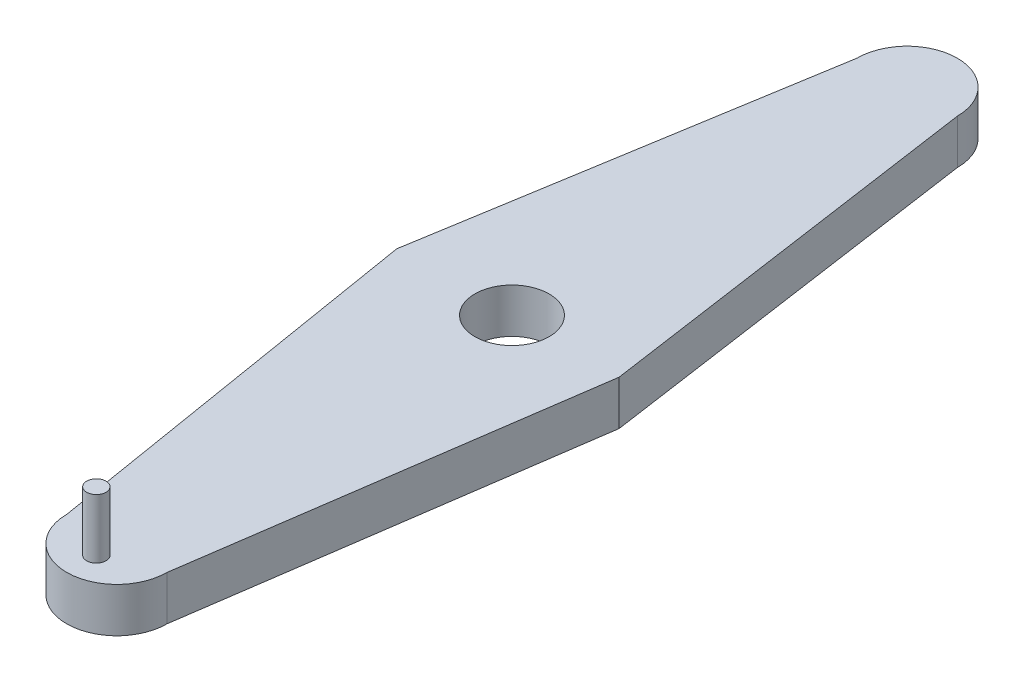
ISO-10303-21;
HEADER;
FILE_DESCRIPTION(('STEP AP214'),'2;1');
FILE_NAME('part.step','',(''),(''),'','','');
FILE_SCHEMA(('AUTOMOTIVE_DESIGN { 1 0 10303 214 1 1 1 1 }'));
ENDSEC;
DATA;
#1=APPLICATION_CONTEXT('core data for automotive mechanical design processes');
#2=APPLICATION_PROTOCOL_DEFINITION('international standard','automotive_design',2000,#1);
#3=PRODUCT_CONTEXT('',#1,'mechanical');
#4=PRODUCT('Part','Part','',(#3));
#5=PRODUCT_RELATED_PRODUCT_CATEGORY('part','',(#4));
#6=PRODUCT_DEFINITION_FORMATION('','',#4);
#7=PRODUCT_DEFINITION_CONTEXT('part definition',#1,'design');
#8=PRODUCT_DEFINITION('design','',#6,#7);
#9=PRODUCT_DEFINITION_SHAPE('','',#8);
#10=(LENGTH_UNIT() NAMED_UNIT(*) SI_UNIT(.MILLI.,.METRE.));
#11=(NAMED_UNIT(*) PLANE_ANGLE_UNIT() SI_UNIT($,.RADIAN.));
#12=(NAMED_UNIT(*) SI_UNIT($,.STERADIAN.) SOLID_ANGLE_UNIT());
#13=UNCERTAINTY_MEASURE_WITH_UNIT(LENGTH_MEASURE(1.E-05),#10,'distance_accuracy_value','');
#14=(GEOMETRIC_REPRESENTATION_CONTEXT(3) GLOBAL_UNCERTAINTY_ASSIGNED_CONTEXT((#13)) GLOBAL_UNIT_ASSIGNED_CONTEXT((#10,
#11,#12)) REPRESENTATION_CONTEXT('',''));
#15=CARTESIAN_POINT('',(0.,0.,0.));
#16=DIRECTION('',(0.,0.,1.));
#17=DIRECTION('',(1.,0.,0.));
#18=AXIS2_PLACEMENT_3D('',#15,#16,#17);
#19=CARTESIAN_POINT('',(-77.6180225801069,30.,0.));
#20=DIRECTION('',(0.986731936220021,0.,-0.162357894921957));
#21=DIRECTION('',(-0.162357894921957,0.,-0.986731936220021));
#22=AXIS2_PLACEMENT_3D('',#19,#20,#21);
#23=PLANE('',#22);
#24=DIRECTION('',(0.162357894921957,0.,0.986731936220021));
#25=VECTOR('',#24,1.);
#26=CARTESIAN_POINT('',(-77.6180225801069,0.,0.));
#27=LINE('',#26,#25);
#28=CARTESIAN_POINT('',(-77.6180225801069,0.,0.));
#29=VERTEX_POINT('',#28);
#30=CARTESIAN_POINT('',(-33.8205860843821,0.,266.179413915618));
#31=VERTEX_POINT('',#30);
#32=EDGE_CURVE('E129',#29,#31,#27,.T.);
#33=ORIENTED_EDGE('',*,*,#32,.T.);
#34=DIRECTION('',(0.,-1.,0.));
#35=VECTOR('',#34,1.);
#36=CARTESIAN_POINT('',(-33.8205860843821,30.,266.179413915618));
#37=LINE('',#36,#35);
#38=CARTESIAN_POINT('',(-33.8205860843821,30.,266.179413915618));
#39=VERTEX_POINT('',#38);
#40=EDGE_CURVE('E48',#39,#31,#37,.T.);
#41=ORIENTED_EDGE('',*,*,#40,.F.);
#42=DIRECTION('',(0.162357894921957,0.,0.986731936220021));
#43=VECTOR('',#42,1.);
#44=CARTESIAN_POINT('',(-77.6180225801069,30.,0.));
#45=LINE('',#44,#43);
#46=CARTESIAN_POINT('',(-77.6180225801069,30.,0.));
#47=VERTEX_POINT('',#46);
#48=EDGE_CURVE('E146',#47,#39,#45,.T.);
#49=ORIENTED_EDGE('',*,*,#48,.F.);
#50=DIRECTION('',(0.,-1.,0.));
#51=VECTOR('',#50,1.);
#52=CARTESIAN_POINT('',(-77.6180225801069,30.,0.));
#53=LINE('',#52,#51);
#54=EDGE_CURVE('E125',#47,#29,#53,.T.);
#55=ORIENTED_EDGE('',*,*,#54,.T.);
#56=EDGE_LOOP('',(#33,#41,#49,#55));
#57=FACE_BOUND('',#56,.T.);
#58=ADVANCED_FACE('F39',(#57),#23,.F.);
#59=CARTESIAN_POINT('',(0.,30.,266.179413915618));
#60=DIRECTION('',(0.,-1.,0.));
#61=DIRECTION('',(0.,0.,-1.));
#62=AXIS2_PLACEMENT_3D('',#59,#60,#61);
#63=CYLINDRICAL_SURFACE('',#62,33.8205860843821);
#64=CARTESIAN_POINT('',(0.,0.,266.179413915618));
#65=DIRECTION('',(0.,1.,0.));
#66=DIRECTION('',(0.,0.,-1.));
#67=AXIS2_PLACEMENT_3D('',#64,#65,#66);
#68=CIRCLE('',#67,33.8205860843821);
#69=CARTESIAN_POINT('',(33.8205860843821,0.,266.179413915618));
#70=VERTEX_POINT('',#69);
#71=EDGE_CURVE('E133',#31,#70,#68,.T.);
#72=ORIENTED_EDGE('',*,*,#71,.T.);
#73=DIRECTION('',(0.,-1.,0.));
#74=VECTOR('',#73,1.);
#75=CARTESIAN_POINT('',(33.8205860843821,30.,266.179413915618));
#76=LINE('',#75,#74);
#77=CARTESIAN_POINT('',(33.8205860843821,30.,266.179413915618));
#78=VERTEX_POINT('',#77);
#79=EDGE_CURVE('E153',#78,#70,#76,.T.);
#80=ORIENTED_EDGE('',*,*,#79,.F.);
#81=CARTESIAN_POINT('',(0.,30.,266.179413915618));
#82=DIRECTION('',(0.,1.,0.));
#83=DIRECTION('',(0.,0.,-1.));
#84=AXIS2_PLACEMENT_3D('',#81,#82,#83);
#85=CIRCLE('',#84,33.8205860843821);
#86=EDGE_CURVE('E94',#39,#78,#85,.T.);
#87=ORIENTED_EDGE('',*,*,#86,.F.);
#88=ORIENTED_EDGE('',*,*,#40,.T.);
#89=EDGE_LOOP('',(#72,#80,#87,#88));
#90=FACE_BOUND('',#89,.T.);
#91=ADVANCED_FACE('F158',(#90),#63,.T.);
#92=CARTESIAN_POINT('',(33.8205860843821,30.,266.179413915618));
#93=DIRECTION('',(-0.989776763720351,0.,-0.142625236193559));
#94=DIRECTION('',(-0.142625236193559,0.,0.989776763720351));
#95=AXIS2_PLACEMENT_3D('',#92,#93,#94);
#96=PLANE('',#95);
#97=DIRECTION('',(0.142625236193559,0.,-0.989776763720351));
#98=VECTOR('',#97,1.);
#99=CARTESIAN_POINT('',(33.8205860843821,0.,266.179413915618));
#100=LINE('',#99,#98);
#101=CARTESIAN_POINT('',(72.1766105649734,0.,0.));
#102=VERTEX_POINT('',#101);
#103=EDGE_CURVE('E137',#70,#102,#100,.T.);
#104=ORIENTED_EDGE('',*,*,#103,.T.);
#105=DIRECTION('',(0.,-1.,0.));
#106=VECTOR('',#105,1.);
#107=CARTESIAN_POINT('',(72.1766105649734,30.,0.));
#108=LINE('',#107,#106);
#109=CARTESIAN_POINT('',(72.1766105649734,30.,0.));
#110=VERTEX_POINT('',#109);
#111=EDGE_CURVE('E118',#110,#102,#108,.T.);
#112=ORIENTED_EDGE('',*,*,#111,.F.);
#113=DIRECTION('',(0.142625236193559,0.,-0.989776763720351));
#114=VECTOR('',#113,1.);
#115=CARTESIAN_POINT('',(33.8205860843821,30.,266.179413915618));
#116=LINE('',#115,#114);
#117=EDGE_CURVE('E107',#78,#110,#116,.T.);
#118=ORIENTED_EDGE('',*,*,#117,.F.);
#119=ORIENTED_EDGE('',*,*,#79,.T.);
#120=EDGE_LOOP('',(#104,#112,#118,#119));
#121=FACE_BOUND('',#120,.T.);
#122=ADVANCED_FACE('F166',(#121),#96,.F.);
#123=CARTESIAN_POINT('',(33.8205860843821,30.,-266.179413915618));
#124=DIRECTION('',(-0.989776763720351,0.,0.142625236193559));
#125=DIRECTION('',(0.142625236193559,0.,0.989776763720351));
#126=AXIS2_PLACEMENT_3D('',#123,#124,#125);
#127=PLANE('',#126);
#128=DIRECTION('',(-0.142625236193559,0.,-0.989776763720351));
#129=VECTOR('',#128,1.);
#130=CARTESIAN_POINT('',(33.8205860843821,0.,-266.179413915618));
#131=LINE('',#130,#129);
#132=CARTESIAN_POINT('',(33.8205860843821,0.,-266.179413915618));
#133=VERTEX_POINT('',#132);
#134=EDGE_CURVE('E116',#102,#133,#131,.T.);
#135=ORIENTED_EDGE('',*,*,#134,.T.);
#136=DIRECTION('',(0.,-1.,0.));
#137=VECTOR('',#136,1.);
#138=CARTESIAN_POINT('',(33.8205860843821,30.,-266.179413915618));
#139=LINE('',#138,#137);
#140=CARTESIAN_POINT('',(33.8205860843821,30.,-266.179413915618));
#141=VERTEX_POINT('',#140);
#142=EDGE_CURVE('E113',#141,#133,#139,.T.);
#143=ORIENTED_EDGE('',*,*,#142,.F.);
#144=DIRECTION('',(-0.142625236193559,0.,-0.989776763720351));
#145=VECTOR('',#144,1.);
#146=CARTESIAN_POINT('',(33.8205860843821,30.,-266.179413915618));
#147=LINE('',#146,#145);
#148=EDGE_CURVE('E101',#110,#141,#147,.T.);
#149=ORIENTED_EDGE('',*,*,#148,.F.);
#150=ORIENTED_EDGE('',*,*,#111,.T.);
#151=EDGE_LOOP('',(#135,#143,#149,#150));
#152=FACE_BOUND('',#151,.T.);
#153=ADVANCED_FACE('F114',(#152),#127,.F.);
#154=CARTESIAN_POINT('',(0.,30.,-266.179413915618));
#155=DIRECTION('',(0.,-1.,0.));
#156=DIRECTION('',(0.,0.,-1.));
#157=AXIS2_PLACEMENT_3D('',#154,#155,#156);
#158=CYLINDRICAL_SURFACE('',#157,33.8205860843821);
#159=CARTESIAN_POINT('',(0.,0.,-266.179413915618));
#160=DIRECTION('',(0.,1.,0.));
#161=DIRECTION('',(0.,0.,1.));
#162=AXIS2_PLACEMENT_3D('',#159,#160,#161);
#163=CIRCLE('',#162,33.8205860843821);
#164=CARTESIAN_POINT('',(-33.8205860843821,0.,-266.179413915618));
#165=VERTEX_POINT('',#164);
#166=EDGE_CURVE('E79',#133,#165,#163,.T.);
#167=ORIENTED_EDGE('',*,*,#166,.T.);
#168=DIRECTION('',(0.,-1.,0.));
#169=VECTOR('',#168,1.);
#170=CARTESIAN_POINT('',(-33.8205860843821,30.,-266.179413915618));
#171=LINE('',#170,#169);
#172=CARTESIAN_POINT('',(-33.8205860843821,30.,-266.179413915618));
#173=VERTEX_POINT('',#172);
#174=EDGE_CURVE('E119',#173,#165,#171,.T.);
#175=ORIENTED_EDGE('',*,*,#174,.F.);
#176=CARTESIAN_POINT('',(0.,30.,-266.179413915618));
#177=DIRECTION('',(0.,1.,0.));
#178=DIRECTION('',(0.,0.,1.));
#179=AXIS2_PLACEMENT_3D('',#176,#177,#178);
#180=CIRCLE('',#179,33.8205860843821);
#181=EDGE_CURVE('E105',#141,#173,#180,.T.);
#182=ORIENTED_EDGE('',*,*,#181,.F.);
#183=ORIENTED_EDGE('',*,*,#142,.T.);
#184=EDGE_LOOP('',(#167,#175,#182,#183));
#185=FACE_BOUND('',#184,.T.);
#186=ADVANCED_FACE('F121',(#185),#158,.T.);
#187=CARTESIAN_POINT('',(-77.6180225801069,30.,0.));
#188=DIRECTION('',(0.986731936220021,0.,0.162357894921957));
#189=DIRECTION('',(0.162357894921957,0.,-0.986731936220021));
#190=AXIS2_PLACEMENT_3D('',#187,#188,#189);
#191=PLANE('',#190);
#192=DIRECTION('',(-0.162357894921957,0.,0.986731936220021));
#193=VECTOR('',#192,1.);
#194=CARTESIAN_POINT('',(-77.6180225801069,0.,0.));
#195=LINE('',#194,#193);
#196=EDGE_CURVE('E85',#165,#29,#195,.T.);
#197=ORIENTED_EDGE('',*,*,#196,.T.);
#198=ORIENTED_EDGE('',*,*,#54,.F.);
#199=DIRECTION('',(-0.162357894921957,0.,0.986731936220021));
#200=VECTOR('',#199,1.);
#201=CARTESIAN_POINT('',(-77.6180225801069,30.,0.));
#202=LINE('',#201,#200);
#203=EDGE_CURVE('E56',#173,#47,#202,.T.);
#204=ORIENTED_EDGE('',*,*,#203,.F.);
#205=ORIENTED_EDGE('',*,*,#174,.T.);
#206=EDGE_LOOP('',(#197,#198,#204,#205));
#207=FACE_BOUND('',#206,.T.);
#208=ADVANCED_FACE('F196',(#207),#191,.F.);
#209=CARTESIAN_POINT('',(0.,30.,266.179413915618));
#210=DIRECTION('',(0.,-1.,0.));
#211=DIRECTION('',(0.,0.,-1.));
#212=AXIS2_PLACEMENT_3D('',#209,#210,#211);
#213=PLANE('',#212);
#214=CARTESIAN_POINT('',(0.,30.,280.));
#215=DIRECTION('',(0.,-1.,0.));
#216=DIRECTION('',(0.,0.,-1.));
#217=AXIS2_PLACEMENT_3D('',#214,#215,#216);
#218=CIRCLE('',#217,6.505);
#219=CARTESIAN_POINT('',(0.,30.,273.495));
#220=VERTEX_POINT('',#219);
#221=EDGE_CURVE('E11',#220,#220,#218,.F.);
#222=ORIENTED_EDGE('',*,*,#221,.F.);
#223=EDGE_LOOP('',(#222));
#224=FACE_BOUND('',#223,.T.);
#225=CARTESIAN_POINT('',(0.,30.,0.));
#226=DIRECTION('',(0.,1.,0.));
#227=DIRECTION('',(0.,0.,1.));
#228=AXIS2_PLACEMENT_3D('',#225,#226,#227);
#229=CIRCLE('',#228,25.);
#230=CARTESIAN_POINT('',(0.,30.,25.));
#231=VERTEX_POINT('',#230);
#232=EDGE_CURVE('E173',#231,#231,#229,.T.);
#233=ORIENTED_EDGE('',*,*,#232,.F.);
#234=EDGE_LOOP('',(#233));
#235=FACE_BOUND('',#234,.T.);
#236=ORIENTED_EDGE('',*,*,#48,.T.);
#237=ORIENTED_EDGE('',*,*,#86,.T.);
#238=ORIENTED_EDGE('',*,*,#117,.T.);
#239=ORIENTED_EDGE('',*,*,#148,.T.);
#240=ORIENTED_EDGE('',*,*,#181,.T.);
#241=ORIENTED_EDGE('',*,*,#203,.T.);
#242=EDGE_LOOP('',(#236,#237,#238,#239,#240,#241));
#243=FACE_BOUND('',#242,.T.);
#244=ADVANCED_FACE('F103',(#224,#235,#243),#213,.F.);
#245=CARTESIAN_POINT('',(0.,0.,266.179413915618));
#246=DIRECTION('',(0.,-1.,0.));
#247=DIRECTION('',(0.,0.,-1.));
#248=AXIS2_PLACEMENT_3D('',#245,#246,#247);
#249=PLANE('',#248);
#250=CARTESIAN_POINT('',(0.,0.,0.));
#251=DIRECTION('',(0.,1.,0.));
#252=DIRECTION('',(0.,0.,1.));
#253=AXIS2_PLACEMENT_3D('',#250,#251,#252);
#254=CIRCLE('',#253,25.);
#255=CARTESIAN_POINT('',(0.,0.,25.));
#256=VERTEX_POINT('',#255);
#257=EDGE_CURVE('E134',#256,#256,#254,.T.);
#258=ORIENTED_EDGE('',*,*,#257,.T.);
#259=EDGE_LOOP('',(#258));
#260=FACE_BOUND('',#259,.T.);
#261=ORIENTED_EDGE('',*,*,#32,.F.);
#262=ORIENTED_EDGE('',*,*,#196,.F.);
#263=ORIENTED_EDGE('',*,*,#166,.F.);
#264=ORIENTED_EDGE('',*,*,#134,.F.);
#265=ORIENTED_EDGE('',*,*,#103,.F.);
#266=ORIENTED_EDGE('',*,*,#71,.F.);
#267=EDGE_LOOP('',(#261,#262,#263,#264,#265,#266));
#268=FACE_BOUND('',#267,.T.);
#269=ADVANCED_FACE('F163',(#260,#268),#249,.T.);
#270=CARTESIAN_POINT('',(0.,0.,0.));
#271=DIRECTION('',(0.,1.,0.));
#272=DIRECTION('',(0.,0.,1.));
#273=AXIS2_PLACEMENT_3D('',#270,#271,#272);
#274=CYLINDRICAL_SURFACE('',#273,25.);
#275=ORIENTED_EDGE('',*,*,#257,.F.);
#276=EDGE_LOOP('',(#275));
#277=FACE_BOUND('',#276,.T.);
#278=ORIENTED_EDGE('',*,*,#232,.T.);
#279=EDGE_LOOP('',(#278));
#280=FACE_BOUND('',#279,.T.);
#281=ADVANCED_FACE('F190',(#277,#280),#274,.F.);
#282=CARTESIAN_POINT('',(0.,70.,280.));
#283=DIRECTION('',(0.,-1.,0.));
#284=DIRECTION('',(0.,0.,-1.));
#285=AXIS2_PLACEMENT_3D('',#282,#283,#284);
#286=CYLINDRICAL_SURFACE('',#285,6.505);
#287=CARTESIAN_POINT('',(0.,70.,280.));
#288=DIRECTION('',(0.,1.,0.));
#289=DIRECTION('',(0.,0.,1.));
#290=AXIS2_PLACEMENT_3D('',#287,#288,#289);
#291=CIRCLE('',#290,6.505);
#292=CARTESIAN_POINT('',(0.,70.,286.505));
#293=VERTEX_POINT('',#292);
#294=EDGE_CURVE('E177',#293,#293,#291,.T.);
#295=ORIENTED_EDGE('',*,*,#294,.F.);
#296=EDGE_LOOP('',(#295));
#297=FACE_BOUND('',#296,.T.);
#298=ORIENTED_EDGE('',*,*,#221,.T.);
#299=EDGE_LOOP('',(#298));
#300=FACE_BOUND('',#299,.T.);
#301=ADVANCED_FACE('F187',(#297,#300),#286,.T.);
#302=CARTESIAN_POINT('',(0.,70.,280.));
#303=DIRECTION('',(0.,1.,0.));
#304=DIRECTION('',(0.,0.,1.));
#305=AXIS2_PLACEMENT_3D('',#302,#303,#304);
#306=PLANE('',#305);
#307=ORIENTED_EDGE('',*,*,#294,.T.);
#308=EDGE_LOOP('',(#307));
#309=FACE_BOUND('',#308,.T.);
#310=ADVANCED_FACE('F185',(#309),#306,.T.);
#311=CLOSED_SHELL('',(#58,#91,#122,#153,#186,#208,#244,#269,#281,#301,#310));
#312=MANIFOLD_SOLID_BREP('B2',#311);
#313=ADVANCED_BREP_SHAPE_REPRESENTATION('',(#18,#312),#14);
#314=SHAPE_DEFINITION_REPRESENTATION(#9,#313);
ENDSEC;
END-ISO-10303-21;
